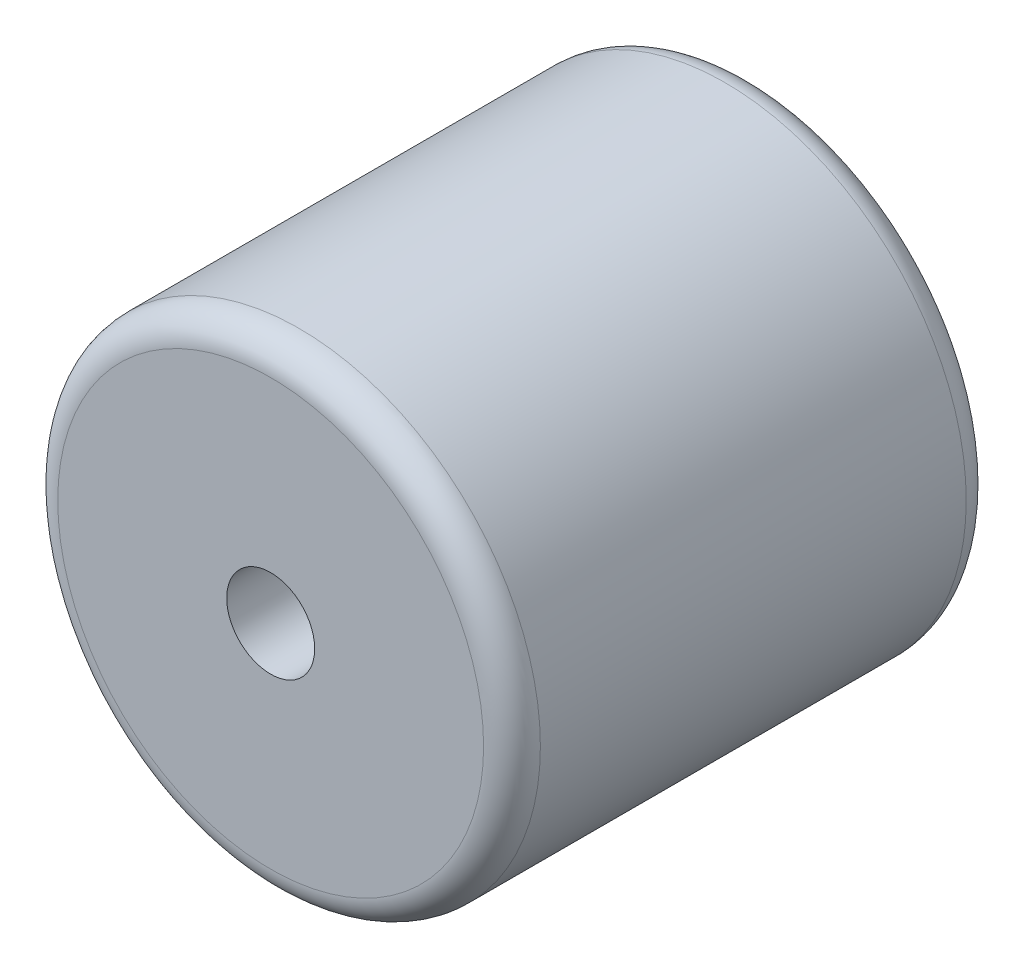
ISO-10303-21;
HEADER;
FILE_DESCRIPTION(('STEP AP214'),'2;1');
FILE_NAME('part.step','',(''),(''),'','','');
FILE_SCHEMA(('AUTOMOTIVE_DESIGN { 1 0 10303 214 1 1 1 1 }'));
ENDSEC;
DATA;
#1=APPLICATION_CONTEXT('core data for automotive mechanical design processes');
#2=APPLICATION_PROTOCOL_DEFINITION('international standard','automotive_design',2000,#1);
#3=PRODUCT_CONTEXT('',#1,'mechanical');
#4=PRODUCT('Part','Part','',(#3));
#5=PRODUCT_RELATED_PRODUCT_CATEGORY('part','',(#4));
#6=PRODUCT_DEFINITION_FORMATION('','',#4);
#7=PRODUCT_DEFINITION_CONTEXT('part definition',#1,'design');
#8=PRODUCT_DEFINITION('design','',#6,#7);
#9=PRODUCT_DEFINITION_SHAPE('','',#8);
#10=(LENGTH_UNIT() NAMED_UNIT(*) SI_UNIT(.MILLI.,.METRE.));
#11=(NAMED_UNIT(*) PLANE_ANGLE_UNIT() SI_UNIT($,.RADIAN.));
#12=(NAMED_UNIT(*) SI_UNIT($,.STERADIAN.) SOLID_ANGLE_UNIT());
#13=UNCERTAINTY_MEASURE_WITH_UNIT(LENGTH_MEASURE(1.E-05),#10,'distance_accuracy_value','');
#14=(GEOMETRIC_REPRESENTATION_CONTEXT(3) GLOBAL_UNCERTAINTY_ASSIGNED_CONTEXT((#13)) GLOBAL_UNIT_ASSIGNED_CONTEXT((#10,
#11,#12)) REPRESENTATION_CONTEXT('',''));
#15=CARTESIAN_POINT('',(0.,0.,0.));
#16=DIRECTION('',(0.,0.,1.));
#17=DIRECTION('',(1.,0.,0.));
#18=AXIS2_PLACEMENT_3D('',#15,#16,#17);
#19=CARTESIAN_POINT('',(0.,0.,8.5));
#20=DIRECTION('',(0.,0.,1.));
#21=DIRECTION('',(1.,0.,0.));
#22=AXIS2_PLACEMENT_3D('',#19,#20,#21);
#23=PLANE('',#22);
#24=CARTESIAN_POINT('',(0.,0.,8.5));
#25=DIRECTION('',(0.,0.,1.));
#26=DIRECTION('',(1.,0.,0.));
#27=AXIS2_PLACEMENT_3D('',#24,#25,#26);
#28=CIRCLE('',#27,7.5);
#29=CARTESIAN_POINT('',(7.5,0.,8.5));
#30=VERTEX_POINT('',#29);
#31=EDGE_CURVE('E10',#30,#30,#28,.T.);
#32=ORIENTED_EDGE('',*,*,#31,.T.);
#33=EDGE_LOOP('',(#32));
#34=FACE_BOUND('',#33,.T.);
#35=CARTESIAN_POINT('',(0.,0.,8.5));
#36=DIRECTION('',(0.,0.,1.));
#37=DIRECTION('',(1.,0.,0.));
#38=AXIS2_PLACEMENT_3D('',#35,#36,#37);
#39=CIRCLE('',#38,1.55);
#40=CARTESIAN_POINT('',(1.55,0.,8.5));
#41=VERTEX_POINT('',#40);
#42=EDGE_CURVE('E51',#41,#41,#39,.T.);
#43=ORIENTED_EDGE('',*,*,#42,.F.);
#44=EDGE_LOOP('',(#43));
#45=FACE_BOUND('',#44,.T.);
#46=ADVANCED_FACE('F31',(#34,#45),#23,.T.);
#47=CARTESIAN_POINT('',(0.,0.,-8.5));
#48=DIRECTION('',(0.,0.,1.));
#49=DIRECTION('',(1.,0.,0.));
#50=AXIS2_PLACEMENT_3D('',#47,#48,#49);
#51=PLANE('',#50);
#52=CARTESIAN_POINT('',(0.,0.,-8.5));
#53=DIRECTION('',(0.,0.,1.));
#54=DIRECTION('',(1.,0.,0.));
#55=AXIS2_PLACEMENT_3D('',#52,#53,#54);
#56=CIRCLE('',#55,7.5);
#57=CARTESIAN_POINT('',(7.5,0.,-8.5));
#58=VERTEX_POINT('',#57);
#59=EDGE_CURVE('E38',#58,#58,#56,.F.);
#60=ORIENTED_EDGE('',*,*,#59,.T.);
#61=EDGE_LOOP('',(#60));
#62=FACE_BOUND('',#61,.T.);
#63=CARTESIAN_POINT('',(0.,0.,-8.5));
#64=DIRECTION('',(0.,0.,1.));
#65=DIRECTION('',(1.,0.,0.));
#66=AXIS2_PLACEMENT_3D('',#63,#64,#65);
#67=CIRCLE('',#66,1.55);
#68=CARTESIAN_POINT('',(1.55,0.,-8.5));
#69=VERTEX_POINT('',#68);
#70=EDGE_CURVE('E52',#69,#69,#67,.T.);
#71=ORIENTED_EDGE('',*,*,#70,.T.);
#72=EDGE_LOOP('',(#71));
#73=FACE_BOUND('',#72,.T.);
#74=ADVANCED_FACE('F62',(#62,#73),#51,.F.);
#75=CARTESIAN_POINT('',(0.,0.,8.5));
#76=DIRECTION('',(0.,0.,-1.));
#77=DIRECTION('',(-1.,0.,0.));
#78=AXIS2_PLACEMENT_3D('',#75,#76,#77);
#79=CYLINDRICAL_SURFACE('',#78,8.5);
#80=CARTESIAN_POINT('',(0.,0.,-7.5));
#81=DIRECTION('',(0.,0.,1.));
#82=DIRECTION('',(1.,0.,0.));
#83=AXIS2_PLACEMENT_3D('',#80,#81,#82);
#84=CIRCLE('',#83,8.5);
#85=CARTESIAN_POINT('',(8.5,0.,-7.5));
#86=VERTEX_POINT('',#85);
#87=EDGE_CURVE('E42',#86,#86,#84,.T.);
#88=ORIENTED_EDGE('',*,*,#87,.T.);
#89=EDGE_LOOP('',(#88));
#90=FACE_BOUND('',#89,.T.);
#91=CARTESIAN_POINT('',(0.,0.,7.5));
#92=DIRECTION('',(0.,0.,1.));
#93=DIRECTION('',(1.,0.,0.));
#94=AXIS2_PLACEMENT_3D('',#91,#92,#93);
#95=CIRCLE('',#94,8.5);
#96=CARTESIAN_POINT('',(8.5,0.,7.5));
#97=VERTEX_POINT('',#96);
#98=EDGE_CURVE('E46',#97,#97,#95,.F.);
#99=ORIENTED_EDGE('',*,*,#98,.T.);
#100=EDGE_LOOP('',(#99));
#101=FACE_BOUND('',#100,.T.);
#102=ADVANCED_FACE('F67',(#90,#101),#79,.T.);
#103=CARTESIAN_POINT('',(0.,0.,8.5));
#104=DIRECTION('',(0.,0.,-1.));
#105=DIRECTION('',(-1.,0.,0.));
#106=AXIS2_PLACEMENT_3D('',#103,#104,#105);
#107=CYLINDRICAL_SURFACE('',#106,1.55);
#108=ORIENTED_EDGE('',*,*,#42,.T.);
#109=EDGE_LOOP('',(#108));
#110=FACE_BOUND('',#109,.T.);
#111=ORIENTED_EDGE('',*,*,#70,.F.);
#112=EDGE_LOOP('',(#111));
#113=FACE_BOUND('',#112,.T.);
#114=ADVANCED_FACE('F58',(#110,#113),#107,.F.);
#115=CARTESIAN_POINT('',(0.,0.,-7.5));
#116=DIRECTION('',(0.,0.,1.));
#117=DIRECTION('',(1.,0.,0.));
#118=AXIS2_PLACEMENT_3D('',#115,#116,#117);
#119=TOROIDAL_SURFACE('',#118,7.5,1.);
#120=ORIENTED_EDGE('',*,*,#59,.F.);
#121=EDGE_LOOP('',(#120));
#122=FACE_BOUND('',#121,.T.);
#123=ORIENTED_EDGE('',*,*,#87,.F.);
#124=EDGE_LOOP('',(#123));
#125=FACE_BOUND('',#124,.T.);
#126=ADVANCED_FACE('F73',(#122,#125),#119,.T.);
#127=CARTESIAN_POINT('',(0.,0.,7.5));
#128=DIRECTION('',(0.,0.,1.));
#129=DIRECTION('',(1.,0.,0.));
#130=AXIS2_PLACEMENT_3D('',#127,#128,#129);
#131=TOROIDAL_SURFACE('',#130,7.5,1.);
#132=ORIENTED_EDGE('',*,*,#98,.F.);
#133=EDGE_LOOP('',(#132));
#134=FACE_BOUND('',#133,.T.);
#135=ORIENTED_EDGE('',*,*,#31,.F.);
#136=EDGE_LOOP('',(#135));
#137=FACE_BOUND('',#136,.T.);
#138=ADVANCED_FACE('F33',(#134,#137),#131,.T.);
#139=CLOSED_SHELL('',(#46,#74,#102,#114,#126,#138));
#140=MANIFOLD_SOLID_BREP('B2',#139);
#141=ADVANCED_BREP_SHAPE_REPRESENTATION('',(#18,#140),#14);
#142=SHAPE_DEFINITION_REPRESENTATION(#9,#141);
ENDSEC;
END-ISO-10303-21;
